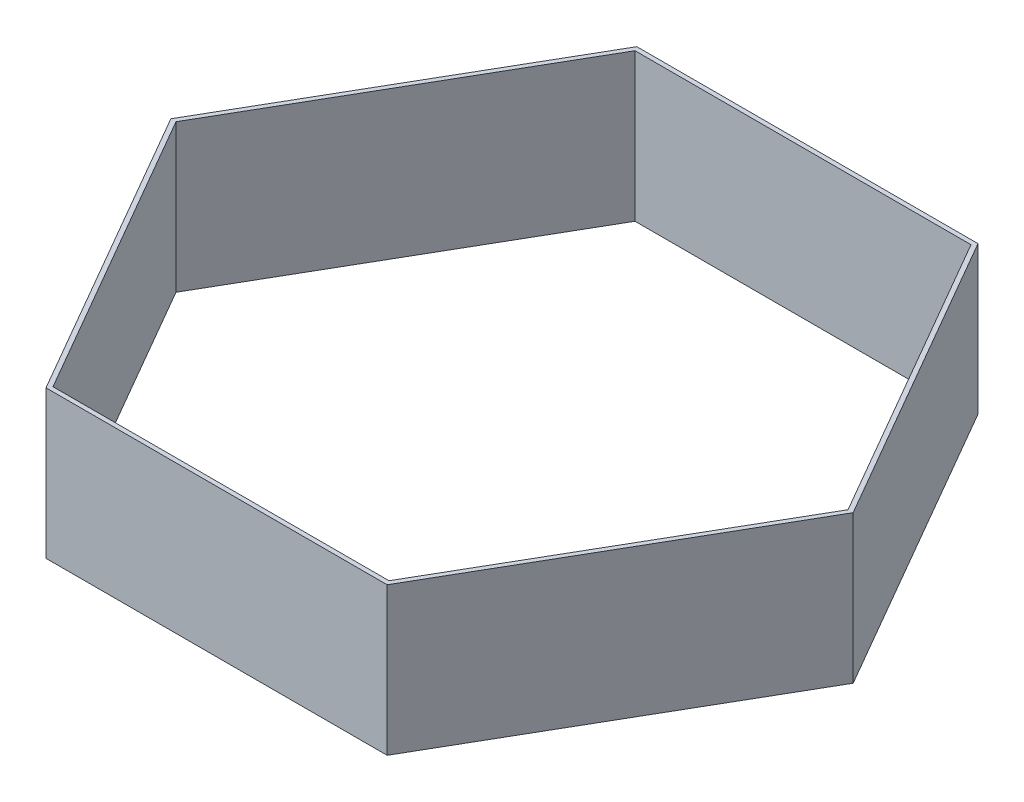
ISO-10303-21;
HEADER;
FILE_DESCRIPTION(('STEP AP214'),'2;1');
FILE_NAME('part.step','',(''),(''),'','','');
FILE_SCHEMA(('AUTOMOTIVE_DESIGN { 1 0 10303 214 1 1 1 1 }'));
ENDSEC;
DATA;
#1=APPLICATION_CONTEXT('core data for automotive mechanical design processes');
#2=APPLICATION_PROTOCOL_DEFINITION('international standard','automotive_design',2000,#1);
#3=PRODUCT_CONTEXT('',#1,'mechanical');
#4=PRODUCT('Part','Part','',(#3));
#5=PRODUCT_RELATED_PRODUCT_CATEGORY('part','',(#4));
#6=PRODUCT_DEFINITION_FORMATION('','',#4);
#7=PRODUCT_DEFINITION_CONTEXT('part definition',#1,'design');
#8=PRODUCT_DEFINITION('design','',#6,#7);
#9=PRODUCT_DEFINITION_SHAPE('','',#8);
#10=(LENGTH_UNIT() NAMED_UNIT(*) SI_UNIT(.MILLI.,.METRE.));
#11=(NAMED_UNIT(*) PLANE_ANGLE_UNIT() SI_UNIT($,.RADIAN.));
#12=(NAMED_UNIT(*) SI_UNIT($,.STERADIAN.) SOLID_ANGLE_UNIT());
#13=UNCERTAINTY_MEASURE_WITH_UNIT(LENGTH_MEASURE(1.E-05),#10,'distance_accuracy_value','');
#14=(GEOMETRIC_REPRESENTATION_CONTEXT(3) GLOBAL_UNCERTAINTY_ASSIGNED_CONTEXT((#13)) GLOBAL_UNIT_ASSIGNED_CONTEXT((#10,
#11,#12)) REPRESENTATION_CONTEXT('',''));
#15=CARTESIAN_POINT('',(0.,0.,0.));
#16=DIRECTION('',(0.,0.,1.));
#17=DIRECTION('',(1.,0.,0.));
#18=AXIS2_PLACEMENT_3D('',#15,#16,#17);
#19=CARTESIAN_POINT('',(0.,100.,0.));
#20=DIRECTION('',(0.,1.,0.));
#21=DIRECTION('',(0.,0.,1.));
#22=AXIS2_PLACEMENT_3D('',#19,#20,#21);
#23=PLANE('',#22);
#24=DIRECTION('',(0.5,0.,0.866025403784439));
#25=VECTOR('',#24,1.);
#26=CARTESIAN_POINT('',(-230.94010767585,100.,0.));
#27=LINE('',#26,#25);
#28=CARTESIAN_POINT('',(-230.94010767585,100.,0.));
#29=VERTEX_POINT('',#28);
#30=CARTESIAN_POINT('',(-115.470053837925,100.,200.));
#31=VERTEX_POINT('',#30);
#32=EDGE_CURVE('E173',#29,#31,#27,.T.);
#33=ORIENTED_EDGE('',*,*,#32,.T.);
#34=DIRECTION('',(1.,0.,0.));
#35=VECTOR('',#34,1.);
#36=CARTESIAN_POINT('',(-115.470053837925,100.,200.));
#37=LINE('',#36,#35);
#38=CARTESIAN_POINT('',(115.470053837925,100.,200.));
#39=VERTEX_POINT('',#38);
#40=EDGE_CURVE('E176',#31,#39,#37,.T.);
#41=ORIENTED_EDGE('',*,*,#40,.T.);
#42=DIRECTION('',(0.5,0.,-0.866025403784439));
#43=VECTOR('',#42,1.);
#44=CARTESIAN_POINT('',(115.470053837925,100.,200.));
#45=LINE('',#44,#43);
#46=CARTESIAN_POINT('',(230.94010767585,100.,0.));
#47=VERTEX_POINT('',#46);
#48=EDGE_CURVE('E179',#39,#47,#45,.T.);
#49=ORIENTED_EDGE('',*,*,#48,.T.);
#50=DIRECTION('',(-0.5,0.,-0.866025403784439));
#51=VECTOR('',#50,1.);
#52=CARTESIAN_POINT('',(230.94010767585,100.,0.));
#53=LINE('',#52,#51);
#54=CARTESIAN_POINT('',(115.470053837925,100.,-200.));
#55=VERTEX_POINT('',#54);
#56=EDGE_CURVE('E181',#47,#55,#53,.T.);
#57=ORIENTED_EDGE('',*,*,#56,.T.);
#58=DIRECTION('',(-1.,0.,0.));
#59=VECTOR('',#58,1.);
#60=CARTESIAN_POINT('',(115.470053837925,100.,-200.));
#61=LINE('',#60,#59);
#62=CARTESIAN_POINT('',(-115.470053837925,100.,-200.));
#63=VERTEX_POINT('',#62);
#64=EDGE_CURVE('E183',#55,#63,#61,.T.);
#65=ORIENTED_EDGE('',*,*,#64,.T.);
#66=DIRECTION('',(-0.5,0.,0.866025403784439));
#67=VECTOR('',#66,1.);
#68=CARTESIAN_POINT('',(-115.470053837925,100.,-200.));
#69=LINE('',#68,#67);
#70=EDGE_CURVE('E185',#63,#29,#69,.T.);
#71=ORIENTED_EDGE('',*,*,#70,.T.);
#72=EDGE_LOOP('',(#33,#41,#49,#57,#65,#71));
#73=FACE_BOUND('',#72,.T.);
#74=DIRECTION('',(0.5,0.,-0.866025403784439));
#75=VECTOR('',#74,1.);
#76=CARTESIAN_POINT('',(113.738003030356,100.,197.));
#77=LINE('',#76,#75);
#78=CARTESIAN_POINT('',(113.738003030356,100.,197.));
#79=VERTEX_POINT('',#78);
#80=CARTESIAN_POINT('',(227.476006060713,100.,0.));
#81=VERTEX_POINT('',#80);
#82=EDGE_CURVE('E130',#79,#81,#77,.T.);
#83=ORIENTED_EDGE('',*,*,#82,.F.);
#84=DIRECTION('',(1.,0.,0.));
#85=VECTOR('',#84,1.);
#86=CARTESIAN_POINT('',(-113.738003030356,100.,197.));
#87=LINE('',#86,#85);
#88=CARTESIAN_POINT('',(-113.738003030356,100.,197.));
#89=VERTEX_POINT('',#88);
#90=EDGE_CURVE('E122',#89,#79,#87,.T.);
#91=ORIENTED_EDGE('',*,*,#90,.F.);
#92=DIRECTION('',(0.5,0.,0.866025403784439));
#93=VECTOR('',#92,1.);
#94=CARTESIAN_POINT('',(-227.476006060713,100.,0.));
#95=LINE('',#94,#93);
#96=CARTESIAN_POINT('',(-227.476006060713,100.,0.));
#97=VERTEX_POINT('',#96);
#98=EDGE_CURVE('E151',#97,#89,#95,.T.);
#99=ORIENTED_EDGE('',*,*,#98,.F.);
#100=DIRECTION('',(-0.5,0.,0.866025403784439));
#101=VECTOR('',#100,1.);
#102=CARTESIAN_POINT('',(-113.738003030356,100.,-197.));
#103=LINE('',#102,#101);
#104=CARTESIAN_POINT('',(-113.738003030356,100.,-197.));
#105=VERTEX_POINT('',#104);
#106=EDGE_CURVE('E149',#105,#97,#103,.T.);
#107=ORIENTED_EDGE('',*,*,#106,.F.);
#108=DIRECTION('',(-1.,0.,0.));
#109=VECTOR('',#108,1.);
#110=CARTESIAN_POINT('',(113.738003030356,100.,-197.));
#111=LINE('',#110,#109);
#112=CARTESIAN_POINT('',(113.738003030356,100.,-197.));
#113=VERTEX_POINT('',#112);
#114=EDGE_CURVE('E145',#113,#105,#111,.T.);
#115=ORIENTED_EDGE('',*,*,#114,.F.);
#116=DIRECTION('',(-0.5,0.,-0.866025403784439));
#117=VECTOR('',#116,1.);
#118=CARTESIAN_POINT('',(227.476006060713,100.,0.));
#119=LINE('',#118,#117);
#120=EDGE_CURVE('E143',#81,#113,#119,.T.);
#121=ORIENTED_EDGE('',*,*,#120,.F.);
#122=EDGE_LOOP('',(#83,#91,#99,#107,#115,#121));
#123=FACE_BOUND('',#122,.T.);
#124=ADVANCED_FACE('F33',(#73,#123),#23,.T.);
#125=CARTESIAN_POINT('',(0.,0.,0.));
#126=DIRECTION('',(0.,1.,0.));
#127=DIRECTION('',(0.,0.,1.));
#128=AXIS2_PLACEMENT_3D('',#125,#126,#127);
#129=PLANE('',#128);
#130=DIRECTION('',(0.5,0.,0.866025403784439));
#131=VECTOR('',#130,1.);
#132=CARTESIAN_POINT('',(-230.94010767585,0.,0.));
#133=LINE('',#132,#131);
#134=CARTESIAN_POINT('',(-230.94010767585,0.,0.));
#135=VERTEX_POINT('',#134);
#136=CARTESIAN_POINT('',(-115.470053837925,0.,200.));
#137=VERTEX_POINT('',#136);
#138=EDGE_CURVE('E138',#135,#137,#133,.T.);
#139=ORIENTED_EDGE('',*,*,#138,.F.);
#140=DIRECTION('',(-0.5,0.,0.866025403784439));
#141=VECTOR('',#140,1.);
#142=CARTESIAN_POINT('',(-115.470053837925,0.,-200.));
#143=LINE('',#142,#141);
#144=CARTESIAN_POINT('',(-115.470053837925,0.,-200.));
#145=VERTEX_POINT('',#144);
#146=EDGE_CURVE('E177',#145,#135,#143,.T.);
#147=ORIENTED_EDGE('',*,*,#146,.F.);
#148=DIRECTION('',(-1.,0.,0.));
#149=VECTOR('',#148,1.);
#150=CARTESIAN_POINT('',(115.470053837925,0.,-200.));
#151=LINE('',#150,#149);
#152=CARTESIAN_POINT('',(115.470053837925,0.,-200.));
#153=VERTEX_POINT('',#152);
#154=EDGE_CURVE('E196',#153,#145,#151,.T.);
#155=ORIENTED_EDGE('',*,*,#154,.F.);
#156=DIRECTION('',(-0.5,0.,-0.866025403784439));
#157=VECTOR('',#156,1.);
#158=CARTESIAN_POINT('',(230.94010767585,0.,0.));
#159=LINE('',#158,#157);
#160=CARTESIAN_POINT('',(230.94010767585,0.,0.));
#161=VERTEX_POINT('',#160);
#162=EDGE_CURVE('E194',#161,#153,#159,.T.);
#163=ORIENTED_EDGE('',*,*,#162,.F.);
#164=DIRECTION('',(0.5,0.,-0.866025403784439));
#165=VECTOR('',#164,1.);
#166=CARTESIAN_POINT('',(115.470053837925,0.,200.));
#167=LINE('',#166,#165);
#168=CARTESIAN_POINT('',(115.470053837925,0.,200.));
#169=VERTEX_POINT('',#168);
#170=EDGE_CURVE('E192',#169,#161,#167,.T.);
#171=ORIENTED_EDGE('',*,*,#170,.F.);
#172=DIRECTION('',(1.,0.,0.));
#173=VECTOR('',#172,1.);
#174=CARTESIAN_POINT('',(-115.470053837925,0.,200.));
#175=LINE('',#174,#173);
#176=EDGE_CURVE('E190',#137,#169,#175,.T.);
#177=ORIENTED_EDGE('',*,*,#176,.F.);
#178=EDGE_LOOP('',(#139,#147,#155,#163,#171,#177));
#179=FACE_BOUND('',#178,.T.);
#180=DIRECTION('',(1.,0.,0.));
#181=VECTOR('',#180,1.);
#182=CARTESIAN_POINT('',(-113.738003030356,0.,197.));
#183=LINE('',#182,#181);
#184=CARTESIAN_POINT('',(-113.738003030356,0.,197.));
#185=VERTEX_POINT('',#184);
#186=CARTESIAN_POINT('',(113.738003030356,0.,197.));
#187=VERTEX_POINT('',#186);
#188=EDGE_CURVE('E56',#185,#187,#183,.T.);
#189=ORIENTED_EDGE('',*,*,#188,.T.);
#190=DIRECTION('',(0.5,0.,-0.866025403784439));
#191=VECTOR('',#190,1.);
#192=CARTESIAN_POINT('',(113.738003030356,0.,197.));
#193=LINE('',#192,#191);
#194=CARTESIAN_POINT('',(227.476006060713,0.,0.));
#195=VERTEX_POINT('',#194);
#196=EDGE_CURVE('E137',#187,#195,#193,.T.);
#197=ORIENTED_EDGE('',*,*,#196,.T.);
#198=DIRECTION('',(-0.5,0.,-0.866025403784439));
#199=VECTOR('',#198,1.);
#200=CARTESIAN_POINT('',(227.476006060713,0.,0.));
#201=LINE('',#200,#199);
#202=CARTESIAN_POINT('',(113.738003030356,0.,-197.));
#203=VERTEX_POINT('',#202);
#204=EDGE_CURVE('E155',#195,#203,#201,.T.);
#205=ORIENTED_EDGE('',*,*,#204,.T.);
#206=DIRECTION('',(-1.,0.,0.));
#207=VECTOR('',#206,1.);
#208=CARTESIAN_POINT('',(113.738003030356,0.,-197.));
#209=LINE('',#208,#207);
#210=CARTESIAN_POINT('',(-113.738003030356,0.,-197.));
#211=VERTEX_POINT('',#210);
#212=EDGE_CURVE('E158',#203,#211,#209,.T.);
#213=ORIENTED_EDGE('',*,*,#212,.T.);
#214=DIRECTION('',(-0.5,0.,0.866025403784439));
#215=VECTOR('',#214,1.);
#216=CARTESIAN_POINT('',(-113.738003030356,0.,-197.));
#217=LINE('',#216,#215);
#218=CARTESIAN_POINT('',(-227.476006060713,0.,0.));
#219=VERTEX_POINT('',#218);
#220=EDGE_CURVE('E161',#211,#219,#217,.T.);
#221=ORIENTED_EDGE('',*,*,#220,.T.);
#222=DIRECTION('',(0.5,0.,0.866025403784439));
#223=VECTOR('',#222,1.);
#224=CARTESIAN_POINT('',(-227.476006060713,0.,0.));
#225=LINE('',#224,#223);
#226=EDGE_CURVE('E131',#219,#185,#225,.T.);
#227=ORIENTED_EDGE('',*,*,#226,.T.);
#228=EDGE_LOOP('',(#189,#197,#205,#213,#221,#227));
#229=FACE_BOUND('',#228,.T.);
#230=ADVANCED_FACE('F220',(#179,#229),#129,.F.);
#231=CARTESIAN_POINT('',(-230.94010767585,100.,0.));
#232=DIRECTION('',(0.866025403784439,0.,-0.5));
#233=DIRECTION('',(-0.5,0.,-0.866025403784439));
#234=AXIS2_PLACEMENT_3D('',#231,#232,#233);
#235=PLANE('',#234);
#236=ORIENTED_EDGE('',*,*,#138,.T.);
#237=DIRECTION('',(0.,-1.,0.));
#238=VECTOR('',#237,1.);
#239=CARTESIAN_POINT('',(-115.470053837925,100.,200.));
#240=LINE('',#239,#238);
#241=EDGE_CURVE('E11',#31,#137,#240,.T.);
#242=ORIENTED_EDGE('',*,*,#241,.F.);
#243=ORIENTED_EDGE('',*,*,#32,.F.);
#244=DIRECTION('',(0.,-1.,0.));
#245=VECTOR('',#244,1.);
#246=CARTESIAN_POINT('',(-230.94010767585,100.,0.));
#247=LINE('',#246,#245);
#248=EDGE_CURVE('E187',#29,#135,#247,.T.);
#249=ORIENTED_EDGE('',*,*,#248,.T.);
#250=EDGE_LOOP('',(#236,#242,#243,#249));
#251=FACE_BOUND('',#250,.T.);
#252=ADVANCED_FACE('F35',(#251),#235,.F.);
#253=CARTESIAN_POINT('',(-115.470053837925,100.,200.));
#254=DIRECTION('',(0.,0.,-1.));
#255=DIRECTION('',(-1.,0.,0.));
#256=AXIS2_PLACEMENT_3D('',#253,#254,#255);
#257=PLANE('',#256);
#258=ORIENTED_EDGE('',*,*,#176,.T.);
#259=DIRECTION('',(0.,-1.,0.));
#260=VECTOR('',#259,1.);
#261=CARTESIAN_POINT('',(115.470053837925,100.,200.));
#262=LINE('',#261,#260);
#263=EDGE_CURVE('E41',#39,#169,#262,.T.);
#264=ORIENTED_EDGE('',*,*,#263,.F.);
#265=ORIENTED_EDGE('',*,*,#40,.F.);
#266=ORIENTED_EDGE('',*,*,#241,.T.);
#267=EDGE_LOOP('',(#258,#264,#265,#266));
#268=FACE_BOUND('',#267,.T.);
#269=ADVANCED_FACE('F237',(#268),#257,.F.);
#270=CARTESIAN_POINT('',(115.470053837925,100.,200.));
#271=DIRECTION('',(-0.866025403784439,0.,-0.5));
#272=DIRECTION('',(-0.5,0.,0.866025403784439));
#273=AXIS2_PLACEMENT_3D('',#270,#271,#272);
#274=PLANE('',#273);
#275=ORIENTED_EDGE('',*,*,#170,.T.);
#276=DIRECTION('',(0.,-1.,0.));
#277=VECTOR('',#276,1.);
#278=CARTESIAN_POINT('',(230.94010767585,100.,0.));
#279=LINE('',#278,#277);
#280=EDGE_CURVE('E207',#47,#161,#279,.T.);
#281=ORIENTED_EDGE('',*,*,#280,.F.);
#282=ORIENTED_EDGE('',*,*,#48,.F.);
#283=ORIENTED_EDGE('',*,*,#263,.T.);
#284=EDGE_LOOP('',(#275,#281,#282,#283));
#285=FACE_BOUND('',#284,.T.);
#286=ADVANCED_FACE('F214',(#285),#274,.F.);
#287=CARTESIAN_POINT('',(230.94010767585,100.,0.));
#288=DIRECTION('',(-0.866025403784439,0.,0.5));
#289=DIRECTION('',(0.5,0.,0.866025403784439));
#290=AXIS2_PLACEMENT_3D('',#287,#288,#289);
#291=PLANE('',#290);
#292=ORIENTED_EDGE('',*,*,#162,.T.);
#293=DIRECTION('',(0.,-1.,0.));
#294=VECTOR('',#293,1.);
#295=CARTESIAN_POINT('',(115.470053837925,100.,-200.));
#296=LINE('',#295,#294);
#297=EDGE_CURVE('E204',#55,#153,#296,.T.);
#298=ORIENTED_EDGE('',*,*,#297,.F.);
#299=ORIENTED_EDGE('',*,*,#56,.F.);
#300=ORIENTED_EDGE('',*,*,#280,.T.);
#301=EDGE_LOOP('',(#292,#298,#299,#300));
#302=FACE_BOUND('',#301,.T.);
#303=ADVANCED_FACE('F226',(#302),#291,.F.);
#304=CARTESIAN_POINT('',(115.470053837925,100.,-200.));
#305=DIRECTION('',(0.,0.,1.));
#306=DIRECTION('',(1.,0.,0.));
#307=AXIS2_PLACEMENT_3D('',#304,#305,#306);
#308=PLANE('',#307);
#309=ORIENTED_EDGE('',*,*,#154,.T.);
#310=DIRECTION('',(0.,-1.,0.));
#311=VECTOR('',#310,1.);
#312=CARTESIAN_POINT('',(-115.470053837925,100.,-200.));
#313=LINE('',#312,#311);
#314=EDGE_CURVE('E201',#63,#145,#313,.T.);
#315=ORIENTED_EDGE('',*,*,#314,.F.);
#316=ORIENTED_EDGE('',*,*,#64,.F.);
#317=ORIENTED_EDGE('',*,*,#297,.T.);
#318=EDGE_LOOP('',(#309,#315,#316,#317));
#319=FACE_BOUND('',#318,.T.);
#320=ADVANCED_FACE('F230',(#319),#308,.F.);
#321=CARTESIAN_POINT('',(-115.470053837925,100.,-200.));
#322=DIRECTION('',(0.866025403784439,0.,0.5));
#323=DIRECTION('',(0.5,0.,-0.866025403784439));
#324=AXIS2_PLACEMENT_3D('',#321,#322,#323);
#325=PLANE('',#324);
#326=ORIENTED_EDGE('',*,*,#146,.T.);
#327=ORIENTED_EDGE('',*,*,#248,.F.);
#328=ORIENTED_EDGE('',*,*,#70,.F.);
#329=ORIENTED_EDGE('',*,*,#314,.T.);
#330=EDGE_LOOP('',(#326,#327,#328,#329));
#331=FACE_BOUND('',#330,.T.);
#332=ADVANCED_FACE('F240',(#331),#325,.F.);
#333=CARTESIAN_POINT('',(-113.738003030356,100.,197.));
#334=DIRECTION('',(0.,0.,-1.));
#335=DIRECTION('',(-1.,0.,0.));
#336=AXIS2_PLACEMENT_3D('',#333,#334,#335);
#337=PLANE('',#336);
#338=ORIENTED_EDGE('',*,*,#188,.F.);
#339=DIRECTION('',(0.,-1.,0.));
#340=VECTOR('',#339,1.);
#341=CARTESIAN_POINT('',(-113.738003030356,100.,197.));
#342=LINE('',#341,#340);
#343=EDGE_CURVE('E126',#89,#185,#342,.T.);
#344=ORIENTED_EDGE('',*,*,#343,.F.);
#345=ORIENTED_EDGE('',*,*,#90,.T.);
#346=DIRECTION('',(0.,-1.,0.));
#347=VECTOR('',#346,1.);
#348=CARTESIAN_POINT('',(113.738003030356,100.,197.));
#349=LINE('',#348,#347);
#350=EDGE_CURVE('E125',#79,#187,#349,.T.);
#351=ORIENTED_EDGE('',*,*,#350,.T.);
#352=EDGE_LOOP('',(#338,#344,#345,#351));
#353=FACE_BOUND('',#352,.T.);
#354=ADVANCED_FACE('F124',(#353),#337,.T.);
#355=CARTESIAN_POINT('',(113.738003030356,100.,197.));
#356=DIRECTION('',(-0.866025403784439,0.,-0.5));
#357=DIRECTION('',(-0.5,0.,0.866025403784439));
#358=AXIS2_PLACEMENT_3D('',#355,#356,#357);
#359=PLANE('',#358);
#360=ORIENTED_EDGE('',*,*,#196,.F.);
#361=ORIENTED_EDGE('',*,*,#350,.F.);
#362=ORIENTED_EDGE('',*,*,#82,.T.);
#363=DIRECTION('',(0.,-1.,0.));
#364=VECTOR('',#363,1.);
#365=CARTESIAN_POINT('',(227.476006060713,100.,0.));
#366=LINE('',#365,#364);
#367=EDGE_CURVE('E139',#81,#195,#366,.T.);
#368=ORIENTED_EDGE('',*,*,#367,.T.);
#369=EDGE_LOOP('',(#360,#361,#362,#368));
#370=FACE_BOUND('',#369,.T.);
#371=ADVANCED_FACE('F134',(#370),#359,.T.);
#372=CARTESIAN_POINT('',(227.476006060713,100.,0.));
#373=DIRECTION('',(-0.866025403784439,0.,0.5));
#374=DIRECTION('',(0.5,0.,0.866025403784439));
#375=AXIS2_PLACEMENT_3D('',#372,#373,#374);
#376=PLANE('',#375);
#377=ORIENTED_EDGE('',*,*,#204,.F.);
#378=ORIENTED_EDGE('',*,*,#367,.F.);
#379=ORIENTED_EDGE('',*,*,#120,.T.);
#380=DIRECTION('',(0.,-1.,0.));
#381=VECTOR('',#380,1.);
#382=CARTESIAN_POINT('',(113.738003030356,100.,-197.));
#383=LINE('',#382,#381);
#384=EDGE_CURVE('E170',#113,#203,#383,.T.);
#385=ORIENTED_EDGE('',*,*,#384,.T.);
#386=EDGE_LOOP('',(#377,#378,#379,#385));
#387=FACE_BOUND('',#386,.T.);
#388=ADVANCED_FACE('F258',(#387),#376,.T.);
#389=CARTESIAN_POINT('',(113.738003030356,100.,-197.));
#390=DIRECTION('',(0.,0.,1.));
#391=DIRECTION('',(1.,0.,0.));
#392=AXIS2_PLACEMENT_3D('',#389,#390,#391);
#393=PLANE('',#392);
#394=ORIENTED_EDGE('',*,*,#212,.F.);
#395=ORIENTED_EDGE('',*,*,#384,.F.);
#396=ORIENTED_EDGE('',*,*,#114,.T.);
#397=DIRECTION('',(0.,-1.,0.));
#398=VECTOR('',#397,1.);
#399=CARTESIAN_POINT('',(-113.738003030356,100.,-197.));
#400=LINE('',#399,#398);
#401=EDGE_CURVE('E168',#105,#211,#400,.T.);
#402=ORIENTED_EDGE('',*,*,#401,.T.);
#403=EDGE_LOOP('',(#394,#395,#396,#402));
#404=FACE_BOUND('',#403,.T.);
#405=ADVANCED_FACE('F261',(#404),#393,.T.);
#406=CARTESIAN_POINT('',(-113.738003030356,100.,-197.));
#407=DIRECTION('',(0.866025403784439,0.,0.5));
#408=DIRECTION('',(0.5,0.,-0.866025403784439));
#409=AXIS2_PLACEMENT_3D('',#406,#407,#408);
#410=PLANE('',#409);
#411=ORIENTED_EDGE('',*,*,#220,.F.);
#412=ORIENTED_EDGE('',*,*,#401,.F.);
#413=ORIENTED_EDGE('',*,*,#106,.T.);
#414=DIRECTION('',(0.,-1.,0.));
#415=VECTOR('',#414,1.);
#416=CARTESIAN_POINT('',(-227.476006060713,100.,0.));
#417=LINE('',#416,#415);
#418=EDGE_CURVE('E48',#97,#219,#417,.T.);
#419=ORIENTED_EDGE('',*,*,#418,.T.);
#420=EDGE_LOOP('',(#411,#412,#413,#419));
#421=FACE_BOUND('',#420,.T.);
#422=ADVANCED_FACE('F265',(#421),#410,.T.);
#423=CARTESIAN_POINT('',(-227.476006060713,100.,0.));
#424=DIRECTION('',(0.866025403784439,0.,-0.5));
#425=DIRECTION('',(-0.5,0.,-0.866025403784439));
#426=AXIS2_PLACEMENT_3D('',#423,#424,#425);
#427=PLANE('',#426);
#428=ORIENTED_EDGE('',*,*,#226,.F.);
#429=ORIENTED_EDGE('',*,*,#418,.F.);
#430=ORIENTED_EDGE('',*,*,#98,.T.);
#431=ORIENTED_EDGE('',*,*,#343,.T.);
#432=EDGE_LOOP('',(#428,#429,#430,#431));
#433=FACE_BOUND('',#432,.T.);
#434=ADVANCED_FACE('F269',(#433),#427,.T.);
#435=CLOSED_SHELL('',(#124,#230,#252,#269,#286,#303,#320,#332,#354,#371,#388,#405,#422,#434));
#436=MANIFOLD_SOLID_BREP('B2',#435);
#437=ADVANCED_BREP_SHAPE_REPRESENTATION('',(#18,#436),#14);
#438=SHAPE_DEFINITION_REPRESENTATION(#9,#437);
ENDSEC;
END-ISO-10303-21;
